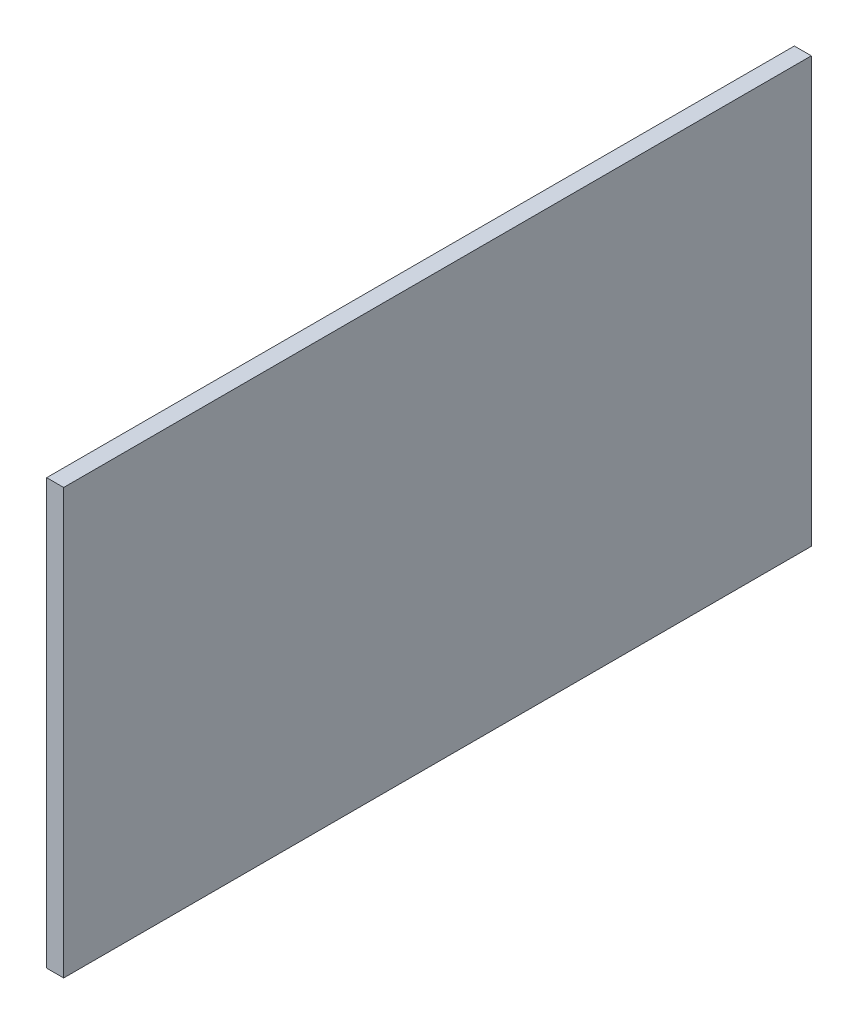
ISO-10303-21;
HEADER;
FILE_DESCRIPTION(('STEP AP214'),'2;1');
FILE_NAME('part.step','',(''),(''),'','','');
FILE_SCHEMA(('AUTOMOTIVE_DESIGN { 1 0 10303 214 1 1 1 1 }'));
ENDSEC;
DATA;
#1=APPLICATION_CONTEXT('core data for automotive mechanical design processes');
#2=APPLICATION_PROTOCOL_DEFINITION('international standard','automotive_design',2000,#1);
#3=PRODUCT_CONTEXT('',#1,'mechanical');
#4=PRODUCT('Part','Part','',(#3));
#5=PRODUCT_RELATED_PRODUCT_CATEGORY('part','',(#4));
#6=PRODUCT_DEFINITION_FORMATION('','',#4);
#7=PRODUCT_DEFINITION_CONTEXT('part definition',#1,'design');
#8=PRODUCT_DEFINITION('design','',#6,#7);
#9=PRODUCT_DEFINITION_SHAPE('','',#8);
#10=(LENGTH_UNIT() NAMED_UNIT(*) SI_UNIT(.MILLI.,.METRE.));
#11=(NAMED_UNIT(*) PLANE_ANGLE_UNIT() SI_UNIT($,.RADIAN.));
#12=(NAMED_UNIT(*) SI_UNIT($,.STERADIAN.) SOLID_ANGLE_UNIT());
#13=UNCERTAINTY_MEASURE_WITH_UNIT(LENGTH_MEASURE(1.E-05),#10,'distance_accuracy_value','');
#14=(GEOMETRIC_REPRESENTATION_CONTEXT(3) GLOBAL_UNCERTAINTY_ASSIGNED_CONTEXT((#13)) GLOBAL_UNIT_ASSIGNED_CONTEXT((#10,
#11,#12)) REPRESENTATION_CONTEXT('',''));
#15=CARTESIAN_POINT('',(0.,0.,0.));
#16=DIRECTION('',(0.,0.,1.));
#17=DIRECTION('',(1.,0.,0.));
#18=AXIS2_PLACEMENT_3D('',#15,#16,#17);
#19=CARTESIAN_POINT('',(-5.,0.,0.));
#20=DIRECTION('',(0.,0.,1.));
#21=DIRECTION('',(1.,0.,0.));
#22=AXIS2_PLACEMENT_3D('',#19,#20,#21);
#23=PLANE('',#22);
#24=DIRECTION('',(0.,-1.,0.));
#25=VECTOR('',#24,1.);
#26=CARTESIAN_POINT('',(0.,0.,0.));
#27=LINE('',#26,#25);
#28=CARTESIAN_POINT('',(0.,125.,0.));
#29=VERTEX_POINT('',#28);
#30=CARTESIAN_POINT('',(0.,0.,0.));
#31=VERTEX_POINT('',#30);
#32=EDGE_CURVE('E110',#29,#31,#27,.T.);
#33=ORIENTED_EDGE('',*,*,#32,.F.);
#34=DIRECTION('',(1.,0.,0.));
#35=VECTOR('',#34,1.);
#36=CARTESIAN_POINT('',(-5.,125.,0.));
#37=LINE('',#36,#35);
#38=CARTESIAN_POINT('',(-5.,125.,0.));
#39=VERTEX_POINT('',#38);
#40=EDGE_CURVE('E11',#39,#29,#37,.T.);
#41=ORIENTED_EDGE('',*,*,#40,.F.);
#42=DIRECTION('',(0.,-1.,0.));
#43=VECTOR('',#42,1.);
#44=CARTESIAN_POINT('',(-5.,0.,0.));
#45=LINE('',#44,#43);
#46=CARTESIAN_POINT('',(-5.,0.,0.));
#47=VERTEX_POINT('',#46);
#48=EDGE_CURVE('E102',#39,#47,#45,.T.);
#49=ORIENTED_EDGE('',*,*,#48,.T.);
#50=DIRECTION('',(1.,0.,0.));
#51=VECTOR('',#50,1.);
#52=CARTESIAN_POINT('',(-5.,0.,0.));
#53=LINE('',#52,#51);
#54=EDGE_CURVE('E43',#47,#31,#53,.T.);
#55=ORIENTED_EDGE('',*,*,#54,.T.);
#56=EDGE_LOOP('',(#33,#41,#49,#55));
#57=FACE_BOUND('',#56,.T.);
#58=ADVANCED_FACE('F40',(#57),#23,.T.);
#59=CARTESIAN_POINT('',(-5.,125.,0.));
#60=DIRECTION('',(0.,1.,0.));
#61=DIRECTION('',(0.,0.,1.));
#62=AXIS2_PLACEMENT_3D('',#59,#60,#61);
#63=PLANE('',#62);
#64=DIRECTION('',(0.,0.,1.));
#65=VECTOR('',#64,1.);
#66=CARTESIAN_POINT('',(0.,125.,0.));
#67=LINE('',#66,#65);
#68=CARTESIAN_POINT('',(0.,125.,-220.));
#69=VERTEX_POINT('',#68);
#70=EDGE_CURVE('E105',#69,#29,#67,.T.);
#71=ORIENTED_EDGE('',*,*,#70,.F.);
#72=DIRECTION('',(1.,0.,0.));
#73=VECTOR('',#72,1.);
#74=CARTESIAN_POINT('',(-5.,125.,-220.));
#75=LINE('',#74,#73);
#76=CARTESIAN_POINT('',(-5.,125.,-220.));
#77=VERTEX_POINT('',#76);
#78=EDGE_CURVE('E50',#77,#69,#75,.T.);
#79=ORIENTED_EDGE('',*,*,#78,.F.);
#80=DIRECTION('',(0.,0.,1.));
#81=VECTOR('',#80,1.);
#82=CARTESIAN_POINT('',(-5.,125.,0.));
#83=LINE('',#82,#81);
#84=EDGE_CURVE('E97',#77,#39,#83,.T.);
#85=ORIENTED_EDGE('',*,*,#84,.T.);
#86=ORIENTED_EDGE('',*,*,#40,.T.);
#87=EDGE_LOOP('',(#71,#79,#85,#86));
#88=FACE_BOUND('',#87,.T.);
#89=ADVANCED_FACE('F126',(#88),#63,.T.);
#90=CARTESIAN_POINT('',(-5.,0.,-220.));
#91=DIRECTION('',(0.,0.,-1.));
#92=DIRECTION('',(-1.,0.,0.));
#93=AXIS2_PLACEMENT_3D('',#90,#91,#92);
#94=PLANE('',#93);
#95=DIRECTION('',(0.,1.,0.));
#96=VECTOR('',#95,1.);
#97=CARTESIAN_POINT('',(0.,0.,-220.));
#98=LINE('',#97,#96);
#99=CARTESIAN_POINT('',(0.,0.,-220.));
#100=VERTEX_POINT('',#99);
#101=EDGE_CURVE('E91',#100,#69,#98,.T.);
#102=ORIENTED_EDGE('',*,*,#101,.F.);
#103=DIRECTION('',(1.,0.,0.));
#104=VECTOR('',#103,1.);
#105=CARTESIAN_POINT('',(-5.,0.,-220.));
#106=LINE('',#105,#104);
#107=CARTESIAN_POINT('',(-5.,0.,-220.));
#108=VERTEX_POINT('',#107);
#109=EDGE_CURVE('E86',#108,#100,#106,.T.);
#110=ORIENTED_EDGE('',*,*,#109,.F.);
#111=DIRECTION('',(0.,1.,0.));
#112=VECTOR('',#111,1.);
#113=CARTESIAN_POINT('',(-5.,0.,-220.));
#114=LINE('',#113,#112);
#115=EDGE_CURVE('E89',#108,#77,#114,.T.);
#116=ORIENTED_EDGE('',*,*,#115,.T.);
#117=ORIENTED_EDGE('',*,*,#78,.T.);
#118=EDGE_LOOP('',(#102,#110,#116,#117));
#119=FACE_BOUND('',#118,.T.);
#120=ADVANCED_FACE('F88',(#119),#94,.T.);
#121=CARTESIAN_POINT('',(-5.,0.,0.));
#122=DIRECTION('',(0.,-1.,0.));
#123=DIRECTION('',(0.,0.,-1.));
#124=AXIS2_PLACEMENT_3D('',#121,#122,#123);
#125=PLANE('',#124);
#126=DIRECTION('',(0.,0.,-1.));
#127=VECTOR('',#126,1.);
#128=CARTESIAN_POINT('',(0.,0.,0.));
#129=LINE('',#128,#127);
#130=EDGE_CURVE('E114',#31,#100,#129,.T.);
#131=ORIENTED_EDGE('',*,*,#130,.F.);
#132=ORIENTED_EDGE('',*,*,#54,.F.);
#133=DIRECTION('',(0.,0.,-1.));
#134=VECTOR('',#133,1.);
#135=CARTESIAN_POINT('',(-5.,0.,0.));
#136=LINE('',#135,#134);
#137=EDGE_CURVE('E96',#47,#108,#136,.T.);
#138=ORIENTED_EDGE('',*,*,#137,.T.);
#139=ORIENTED_EDGE('',*,*,#109,.T.);
#140=EDGE_LOOP('',(#131,#132,#138,#139));
#141=FACE_BOUND('',#140,.T.);
#142=ADVANCED_FACE('F100',(#141),#125,.T.);
#143=CARTESIAN_POINT('',(-5.,0.,0.));
#144=DIRECTION('',(-1.,0.,0.));
#145=DIRECTION('',(0.,0.,1.));
#146=AXIS2_PLACEMENT_3D('',#143,#144,#145);
#147=PLANE('',#146);
#148=ORIENTED_EDGE('',*,*,#48,.F.);
#149=ORIENTED_EDGE('',*,*,#84,.F.);
#150=ORIENTED_EDGE('',*,*,#115,.F.);
#151=ORIENTED_EDGE('',*,*,#137,.F.);
#152=EDGE_LOOP('',(#148,#149,#150,#151));
#153=FACE_BOUND('',#152,.T.);
#154=ADVANCED_FACE('F95',(#153),#147,.T.);
#155=CARTESIAN_POINT('',(0.,0.,0.));
#156=DIRECTION('',(-1.,0.,0.));
#157=DIRECTION('',(0.,0.,1.));
#158=AXIS2_PLACEMENT_3D('',#155,#156,#157);
#159=PLANE('',#158);
#160=ORIENTED_EDGE('',*,*,#32,.T.);
#161=ORIENTED_EDGE('',*,*,#130,.T.);
#162=ORIENTED_EDGE('',*,*,#101,.T.);
#163=ORIENTED_EDGE('',*,*,#70,.T.);
#164=EDGE_LOOP('',(#160,#161,#162,#163));
#165=FACE_BOUND('',#164,.T.);
#166=ADVANCED_FACE('F125',(#165),#159,.F.);
#167=CLOSED_SHELL('',(#58,#89,#120,#142,#154,#166));
#168=MANIFOLD_SOLID_BREP('B2',#167);
#169=ADVANCED_BREP_SHAPE_REPRESENTATION('',(#18,#168),#14);
#170=SHAPE_DEFINITION_REPRESENTATION(#9,#169);
ENDSEC;
END-ISO-10303-21;
